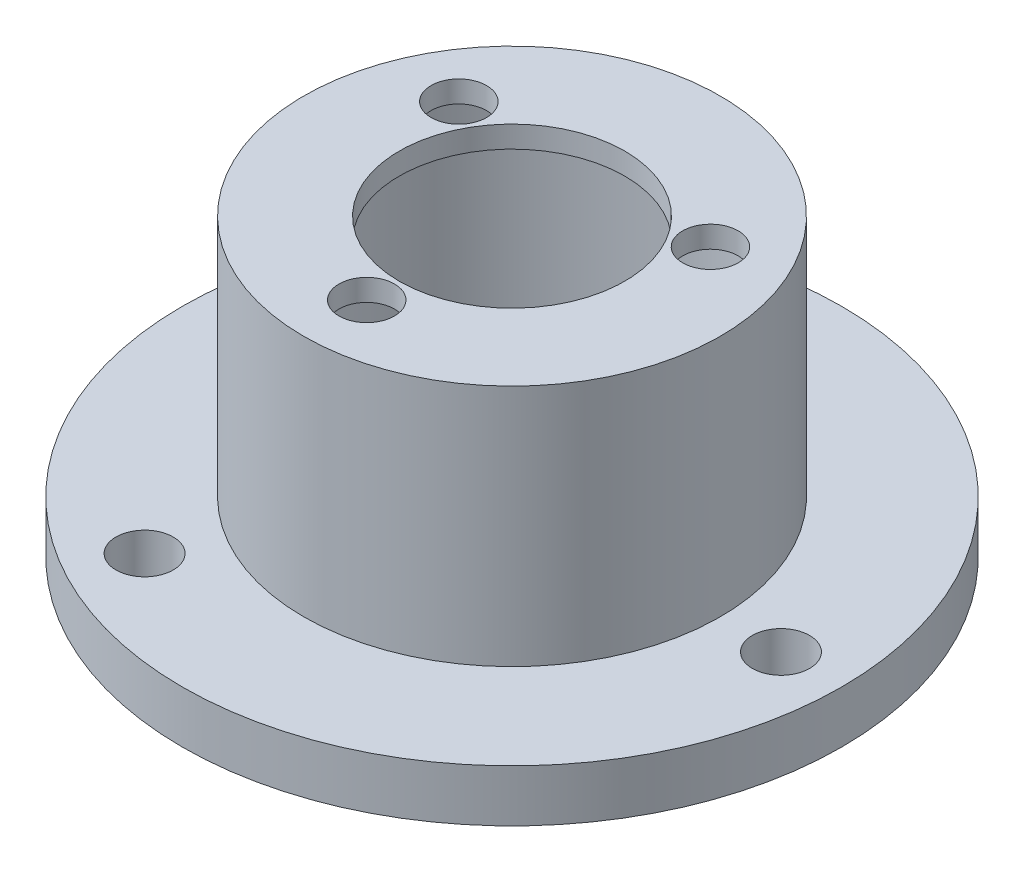
ISO-10303-21;
HEADER;
FILE_DESCRIPTION(('STEP AP214'),'2;1');
FILE_NAME('part.step','',(''),(''),'','','');
FILE_SCHEMA(('AUTOMOTIVE_DESIGN { 1 0 10303 214 1 1 1 1 }'));
ENDSEC;
DATA;
#1=APPLICATION_CONTEXT('core data for automotive mechanical design processes');
#2=APPLICATION_PROTOCOL_DEFINITION('international standard','automotive_design',2000,#1);
#3=PRODUCT_CONTEXT('',#1,'mechanical');
#4=PRODUCT('Part','Part','',(#3));
#5=PRODUCT_RELATED_PRODUCT_CATEGORY('part','',(#4));
#6=PRODUCT_DEFINITION_FORMATION('','',#4);
#7=PRODUCT_DEFINITION_CONTEXT('part definition',#1,'design');
#8=PRODUCT_DEFINITION('design','',#6,#7);
#9=PRODUCT_DEFINITION_SHAPE('','',#8);
#10=(LENGTH_UNIT() NAMED_UNIT(*) SI_UNIT(.MILLI.,.METRE.));
#11=(NAMED_UNIT(*) PLANE_ANGLE_UNIT() SI_UNIT($,.RADIAN.));
#12=(NAMED_UNIT(*) SI_UNIT($,.STERADIAN.) SOLID_ANGLE_UNIT());
#13=UNCERTAINTY_MEASURE_WITH_UNIT(LENGTH_MEASURE(1.E-05),#10,'distance_accuracy_value','');
#14=(GEOMETRIC_REPRESENTATION_CONTEXT(3) GLOBAL_UNCERTAINTY_ASSIGNED_CONTEXT((#13)) GLOBAL_UNIT_ASSIGNED_CONTEXT((#10,
#11,#12)) REPRESENTATION_CONTEXT('',''));
#15=CARTESIAN_POINT('',(0.,0.,0.));
#16=DIRECTION('',(0.,0.,1.));
#17=DIRECTION('',(1.,0.,0.));
#18=AXIS2_PLACEMENT_3D('',#15,#16,#17);
#19=CARTESIAN_POINT('',(0.,3.,0.));
#20=DIRECTION('',(0.,-1.,0.));
#21=DIRECTION('',(0.,0.,-1.));
#22=AXIS2_PLACEMENT_3D('',#19,#20,#21);
#23=CYLINDRICAL_SURFACE('',#22,11.);
#24=CARTESIAN_POINT('',(0.,0.,0.));
#25=DIRECTION('',(0.,1.,0.));
#26=DIRECTION('',(0.,0.,1.));
#27=AXIS2_PLACEMENT_3D('',#24,#25,#26);
#28=CIRCLE('',#27,11.);
#29=CARTESIAN_POINT('',(0.,0.,11.));
#30=VERTEX_POINT('',#29);
#31=EDGE_CURVE('E58',#30,#30,#28,.T.);
#32=ORIENTED_EDGE('',*,*,#31,.F.);
#33=EDGE_LOOP('',(#32));
#34=FACE_BOUND('',#33,.T.);
#35=CARTESIAN_POINT('',(0.,15.75,0.));
#36=DIRECTION('',(0.,1.,0.));
#37=DIRECTION('',(0.,0.,1.));
#38=AXIS2_PLACEMENT_3D('',#35,#36,#37);
#39=CIRCLE('',#38,11.);
#40=CARTESIAN_POINT('',(0.,15.75,11.));
#41=VERTEX_POINT('',#40);
#42=EDGE_CURVE('E66',#41,#41,#39,.T.);
#43=ORIENTED_EDGE('',*,*,#42,.T.);
#44=EDGE_LOOP('',(#43));
#45=FACE_BOUND('',#44,.T.);
#46=ADVANCED_FACE('F45',(#34,#45),#23,.F.);
#47=CARTESIAN_POINT('',(0.,3.,0.));
#48=DIRECTION('',(0.,1.,0.));
#49=DIRECTION('',(0.,0.,1.));
#50=AXIS2_PLACEMENT_3D('',#47,#48,#49);
#51=PLANE('',#50);
#52=CARTESIAN_POINT('',(-7.75000000000001,3.,-13.4233937586588));
#53=DIRECTION('',(0.,1.,0.));
#54=DIRECTION('',(0.,0.,1.));
#55=AXIS2_PLACEMENT_3D('',#52,#53,#54);
#56=CIRCLE('',#55,1.65);
#57=CARTESIAN_POINT('',(-7.75000000000001,3.,-11.7733937586588));
#58=VERTEX_POINT('',#57);
#59=EDGE_CURVE('E107',#58,#58,#56,.T.);
#60=ORIENTED_EDGE('',*,*,#59,.F.);
#61=EDGE_LOOP('',(#60));
#62=FACE_BOUND('',#61,.T.);
#63=CARTESIAN_POINT('',(-7.75000000000001,3.,13.4233937586588));
#64=DIRECTION('',(0.,1.,0.));
#65=DIRECTION('',(0.,0.,1.));
#66=AXIS2_PLACEMENT_3D('',#63,#64,#65);
#67=CIRCLE('',#66,1.65);
#68=CARTESIAN_POINT('',(-7.75000000000001,3.,15.0733937586588));
#69=VERTEX_POINT('',#68);
#70=EDGE_CURVE('E101',#69,#69,#67,.T.);
#71=ORIENTED_EDGE('',*,*,#70,.F.);
#72=EDGE_LOOP('',(#71));
#73=FACE_BOUND('',#72,.T.);
#74=CARTESIAN_POINT('',(15.5,3.,0.));
#75=DIRECTION('',(0.,1.,0.));
#76=DIRECTION('',(0.,0.,1.));
#77=AXIS2_PLACEMENT_3D('',#74,#75,#76);
#78=CIRCLE('',#77,1.65);
#79=CARTESIAN_POINT('',(15.5,3.,1.65));
#80=VERTEX_POINT('',#79);
#81=EDGE_CURVE('E95',#80,#80,#78,.T.);
#82=ORIENTED_EDGE('',*,*,#81,.F.);
#83=EDGE_LOOP('',(#82));
#84=FACE_BOUND('',#83,.T.);
#85=CARTESIAN_POINT('',(0.,3.,0.));
#86=DIRECTION('',(0.,1.,0.));
#87=DIRECTION('',(0.,0.,1.));
#88=AXIS2_PLACEMENT_3D('',#85,#86,#87);
#89=CIRCLE('',#88,19.);
#90=CARTESIAN_POINT('',(0.,3.,19.));
#91=VERTEX_POINT('',#90);
#92=EDGE_CURVE('E10',#91,#91,#89,.T.);
#93=ORIENTED_EDGE('',*,*,#92,.T.);
#94=EDGE_LOOP('',(#93));
#95=FACE_BOUND('',#94,.T.);
#96=CARTESIAN_POINT('',(0.,3.,0.));
#97=DIRECTION('',(0.,1.,0.));
#98=DIRECTION('',(0.,0.,1.));
#99=AXIS2_PLACEMENT_3D('',#96,#97,#98);
#100=CIRCLE('',#99,12.);
#101=CARTESIAN_POINT('',(0.,3.,12.));
#102=VERTEX_POINT('',#101);
#103=EDGE_CURVE('E63',#102,#102,#100,.T.);
#104=ORIENTED_EDGE('',*,*,#103,.F.);
#105=EDGE_LOOP('',(#104));
#106=FACE_BOUND('',#105,.T.);
#107=ADVANCED_FACE('F113',(#62,#73,#84,#95,#106),#51,.T.);
#108=CARTESIAN_POINT('',(0.,0.,0.));
#109=DIRECTION('',(0.,1.,0.));
#110=DIRECTION('',(0.,0.,1.));
#111=AXIS2_PLACEMENT_3D('',#108,#109,#110);
#112=PLANE('',#111);
#113=CARTESIAN_POINT('',(-7.75000000000001,0.,-13.4233937586588));
#114=DIRECTION('',(0.,1.,0.));
#115=DIRECTION('',(0.,0.,1.));
#116=AXIS2_PLACEMENT_3D('',#113,#114,#115);
#117=CIRCLE('',#116,1.65);
#118=CARTESIAN_POINT('',(-7.75000000000001,0.,-11.7733937586588));
#119=VERTEX_POINT('',#118);
#120=EDGE_CURVE('E104',#119,#119,#117,.T.);
#121=ORIENTED_EDGE('',*,*,#120,.T.);
#122=EDGE_LOOP('',(#121));
#123=FACE_BOUND('',#122,.T.);
#124=CARTESIAN_POINT('',(-7.75000000000001,0.,13.4233937586588));
#125=DIRECTION('',(0.,1.,0.));
#126=DIRECTION('',(0.,0.,1.));
#127=AXIS2_PLACEMENT_3D('',#124,#125,#126);
#128=CIRCLE('',#127,1.65);
#129=CARTESIAN_POINT('',(-7.75000000000001,0.,15.0733937586588));
#130=VERTEX_POINT('',#129);
#131=EDGE_CURVE('E98',#130,#130,#128,.T.);
#132=ORIENTED_EDGE('',*,*,#131,.T.);
#133=EDGE_LOOP('',(#132));
#134=FACE_BOUND('',#133,.T.);
#135=CARTESIAN_POINT('',(15.5,0.,0.));
#136=DIRECTION('',(0.,1.,0.));
#137=DIRECTION('',(0.,0.,1.));
#138=AXIS2_PLACEMENT_3D('',#135,#136,#137);
#139=CIRCLE('',#138,1.65);
#140=CARTESIAN_POINT('',(15.5,0.,1.65));
#141=VERTEX_POINT('',#140);
#142=EDGE_CURVE('E92',#141,#141,#139,.T.);
#143=ORIENTED_EDGE('',*,*,#142,.T.);
#144=EDGE_LOOP('',(#143));
#145=FACE_BOUND('',#144,.T.);
#146=CARTESIAN_POINT('',(0.,0.,0.));
#147=DIRECTION('',(0.,1.,0.));
#148=DIRECTION('',(0.,0.,1.));
#149=AXIS2_PLACEMENT_3D('',#146,#147,#148);
#150=CIRCLE('',#149,19.);
#151=CARTESIAN_POINT('',(0.,0.,19.));
#152=VERTEX_POINT('',#151);
#153=EDGE_CURVE('E53',#152,#152,#150,.T.);
#154=ORIENTED_EDGE('',*,*,#153,.F.);
#155=EDGE_LOOP('',(#154));
#156=FACE_BOUND('',#155,.T.);
#157=ORIENTED_EDGE('',*,*,#31,.T.);
#158=EDGE_LOOP('',(#157));
#159=FACE_BOUND('',#158,.T.);
#160=ADVANCED_FACE('F116',(#123,#134,#145,#156,#159),#112,.F.);
#161=CARTESIAN_POINT('',(0.,3.,0.));
#162=DIRECTION('',(0.,-1.,0.));
#163=DIRECTION('',(0.,0.,-1.));
#164=AXIS2_PLACEMENT_3D('',#161,#162,#163);
#165=CYLINDRICAL_SURFACE('',#164,19.);
#166=ORIENTED_EDGE('',*,*,#92,.F.);
#167=EDGE_LOOP('',(#166));
#168=FACE_BOUND('',#167,.T.);
#169=ORIENTED_EDGE('',*,*,#153,.T.);
#170=EDGE_LOOP('',(#169));
#171=FACE_BOUND('',#170,.T.);
#172=ADVANCED_FACE('F47',(#168,#171),#165,.T.);
#173=CARTESIAN_POINT('',(0.,17.,0.));
#174=DIRECTION('',(0.,1.,0.));
#175=DIRECTION('',(0.,0.,1.));
#176=AXIS2_PLACEMENT_3D('',#173,#174,#175);
#177=PLANE('',#176);
#178=CARTESIAN_POINT('',(-7.25,17.,-4.18586835487436));
#179=DIRECTION('',(0.,1.,0.));
#180=DIRECTION('',(0.,0.,1.));
#181=AXIS2_PLACEMENT_3D('',#178,#179,#180);
#182=CIRCLE('',#181,1.6);
#183=CARTESIAN_POINT('',(-7.25,17.,-2.58586835487436));
#184=VERTEX_POINT('',#183);
#185=EDGE_CURVE('E89',#184,#184,#182,.T.);
#186=ORIENTED_EDGE('',*,*,#185,.F.);
#187=EDGE_LOOP('',(#186));
#188=FACE_BOUND('',#187,.T.);
#189=CARTESIAN_POINT('',(7.25,17.,-4.18586835487436));
#190=DIRECTION('',(0.,1.,0.));
#191=DIRECTION('',(0.,0.,1.));
#192=AXIS2_PLACEMENT_3D('',#189,#190,#191);
#193=CIRCLE('',#192,1.6);
#194=CARTESIAN_POINT('',(7.25,17.,-2.58586835487436));
#195=VERTEX_POINT('',#194);
#196=EDGE_CURVE('E86',#195,#195,#193,.T.);
#197=ORIENTED_EDGE('',*,*,#196,.F.);
#198=EDGE_LOOP('',(#197));
#199=FACE_BOUND('',#198,.T.);
#200=CARTESIAN_POINT('',(0.,17.,8.3715));
#201=DIRECTION('',(0.,1.,0.));
#202=DIRECTION('',(0.,0.,1.));
#203=AXIS2_PLACEMENT_3D('',#200,#201,#202);
#204=CIRCLE('',#203,1.6);
#205=CARTESIAN_POINT('',(0.,17.,9.9715));
#206=VERTEX_POINT('',#205);
#207=EDGE_CURVE('E80',#206,#206,#204,.T.);
#208=ORIENTED_EDGE('',*,*,#207,.F.);
#209=EDGE_LOOP('',(#208));
#210=FACE_BOUND('',#209,.T.);
#211=CARTESIAN_POINT('',(0.,17.,0.));
#212=DIRECTION('',(0.,1.,0.));
#213=DIRECTION('',(0.,0.,1.));
#214=AXIS2_PLACEMENT_3D('',#211,#212,#213);
#215=CIRCLE('',#214,12.);
#216=CARTESIAN_POINT('',(0.,17.,12.));
#217=VERTEX_POINT('',#216);
#218=EDGE_CURVE('E62',#217,#217,#215,.T.);
#219=ORIENTED_EDGE('',*,*,#218,.T.);
#220=EDGE_LOOP('',(#219));
#221=FACE_BOUND('',#220,.T.);
#222=CARTESIAN_POINT('',(0.,17.,0.));
#223=DIRECTION('',(0.,1.,0.));
#224=DIRECTION('',(0.,0.,1.));
#225=AXIS2_PLACEMENT_3D('',#222,#223,#224);
#226=CIRCLE('',#225,6.5);
#227=CARTESIAN_POINT('',(0.,17.,6.5));
#228=VERTEX_POINT('',#227);
#229=EDGE_CURVE('E72',#228,#228,#226,.T.);
#230=ORIENTED_EDGE('',*,*,#229,.F.);
#231=EDGE_LOOP('',(#230));
#232=FACE_BOUND('',#231,.T.);
#233=ADVANCED_FACE('F127',(#188,#199,#210,#221,#232),#177,.T.);
#234=CARTESIAN_POINT('',(0.,17.,0.));
#235=DIRECTION('',(0.,-1.,0.));
#236=DIRECTION('',(0.,0.,-1.));
#237=AXIS2_PLACEMENT_3D('',#234,#235,#236);
#238=CYLINDRICAL_SURFACE('',#237,12.);
#239=ORIENTED_EDGE('',*,*,#218,.F.);
#240=EDGE_LOOP('',(#239));
#241=FACE_BOUND('',#240,.T.);
#242=ORIENTED_EDGE('',*,*,#103,.T.);
#243=EDGE_LOOP('',(#242));
#244=FACE_BOUND('',#243,.T.);
#245=ADVANCED_FACE('F124',(#241,#244),#238,.T.);
#246=CARTESIAN_POINT('',(0.,15.75,0.));
#247=DIRECTION('',(0.,1.,0.));
#248=DIRECTION('',(0.,0.,1.));
#249=AXIS2_PLACEMENT_3D('',#246,#247,#248);
#250=PLANE('',#249);
#251=CARTESIAN_POINT('',(-7.25,15.75,-4.18586835487436));
#252=DIRECTION('',(0.,1.,0.));
#253=DIRECTION('',(0.,0.,1.));
#254=AXIS2_PLACEMENT_3D('',#251,#252,#253);
#255=CIRCLE('',#254,1.6);
#256=CARTESIAN_POINT('',(-7.25,15.75,-2.58586835487436));
#257=VERTEX_POINT('',#256);
#258=EDGE_CURVE('E49',#257,#257,#255,.T.);
#259=ORIENTED_EDGE('',*,*,#258,.T.);
#260=EDGE_LOOP('',(#259));
#261=FACE_BOUND('',#260,.T.);
#262=CARTESIAN_POINT('',(7.25,15.75,-4.18586835487436));
#263=DIRECTION('',(0.,1.,0.));
#264=DIRECTION('',(0.,0.,1.));
#265=AXIS2_PLACEMENT_3D('',#262,#263,#264);
#266=CIRCLE('',#265,1.6);
#267=CARTESIAN_POINT('',(7.25,15.75,-2.58586835487436));
#268=VERTEX_POINT('',#267);
#269=EDGE_CURVE('E83',#268,#268,#266,.T.);
#270=ORIENTED_EDGE('',*,*,#269,.T.);
#271=EDGE_LOOP('',(#270));
#272=FACE_BOUND('',#271,.T.);
#273=CARTESIAN_POINT('',(0.,15.75,8.3715));
#274=DIRECTION('',(0.,1.,0.));
#275=DIRECTION('',(0.,0.,1.));
#276=AXIS2_PLACEMENT_3D('',#273,#274,#275);
#277=CIRCLE('',#276,1.6);
#278=CARTESIAN_POINT('',(0.,15.75,9.9715));
#279=VERTEX_POINT('',#278);
#280=EDGE_CURVE('E75',#279,#279,#277,.T.);
#281=ORIENTED_EDGE('',*,*,#280,.T.);
#282=EDGE_LOOP('',(#281));
#283=FACE_BOUND('',#282,.T.);
#284=ORIENTED_EDGE('',*,*,#42,.F.);
#285=EDGE_LOOP('',(#284));
#286=FACE_BOUND('',#285,.T.);
#287=CARTESIAN_POINT('',(0.,15.75,0.));
#288=DIRECTION('',(0.,1.,0.));
#289=DIRECTION('',(0.,0.,1.));
#290=AXIS2_PLACEMENT_3D('',#287,#288,#289);
#291=CIRCLE('',#290,6.5);
#292=CARTESIAN_POINT('',(0.,15.75,6.5));
#293=VERTEX_POINT('',#292);
#294=EDGE_CURVE('E71',#293,#293,#291,.T.);
#295=ORIENTED_EDGE('',*,*,#294,.T.);
#296=EDGE_LOOP('',(#295));
#297=FACE_BOUND('',#296,.T.);
#298=ADVANCED_FACE('F126',(#261,#272,#283,#286,#297),#250,.F.);
#299=CARTESIAN_POINT('',(0.,15.75,0.));
#300=DIRECTION('',(0.,1.,0.));
#301=DIRECTION('',(0.,0.,1.));
#302=AXIS2_PLACEMENT_3D('',#299,#300,#301);
#303=CYLINDRICAL_SURFACE('',#302,6.5);
#304=ORIENTED_EDGE('',*,*,#294,.F.);
#305=EDGE_LOOP('',(#304));
#306=FACE_BOUND('',#305,.T.);
#307=ORIENTED_EDGE('',*,*,#229,.T.);
#308=EDGE_LOOP('',(#307));
#309=FACE_BOUND('',#308,.T.);
#310=ADVANCED_FACE('F135',(#306,#309),#303,.F.);
#311=CARTESIAN_POINT('',(0.,17.,8.3715));
#312=DIRECTION('',(0.,1.,0.));
#313=DIRECTION('',(0.,0.,1.));
#314=AXIS2_PLACEMENT_3D('',#311,#312,#313);
#315=CYLINDRICAL_SURFACE('',#314,1.6);
#316=ORIENTED_EDGE('',*,*,#207,.T.);
#317=EDGE_LOOP('',(#316));
#318=FACE_BOUND('',#317,.T.);
#319=ORIENTED_EDGE('',*,*,#280,.F.);
#320=EDGE_LOOP('',(#319));
#321=FACE_BOUND('',#320,.T.);
#322=ADVANCED_FACE('F184',(#318,#321),#315,.F.);
#323=CARTESIAN_POINT('',(7.25,17.,-4.18586835487436));
#324=DIRECTION('',(0.,1.,0.));
#325=DIRECTION('',(0.,0.,1.));
#326=AXIS2_PLACEMENT_3D('',#323,#324,#325);
#327=CYLINDRICAL_SURFACE('',#326,1.6);
#328=ORIENTED_EDGE('',*,*,#196,.T.);
#329=EDGE_LOOP('',(#328));
#330=FACE_BOUND('',#329,.T.);
#331=ORIENTED_EDGE('',*,*,#269,.F.);
#332=EDGE_LOOP('',(#331));
#333=FACE_BOUND('',#332,.T.);
#334=ADVANCED_FACE('F177',(#330,#333),#327,.F.);
#335=CARTESIAN_POINT('',(-7.25,17.,-4.18586835487436));
#336=DIRECTION('',(0.,1.,0.));
#337=DIRECTION('',(0.,0.,1.));
#338=AXIS2_PLACEMENT_3D('',#335,#336,#337);
#339=CYLINDRICAL_SURFACE('',#338,1.6);
#340=ORIENTED_EDGE('',*,*,#185,.T.);
#341=EDGE_LOOP('',(#340));
#342=FACE_BOUND('',#341,.T.);
#343=ORIENTED_EDGE('',*,*,#258,.F.);
#344=EDGE_LOOP('',(#343));
#345=FACE_BOUND('',#344,.T.);
#346=ADVANCED_FACE('F169',(#342,#345),#339,.F.);
#347=CARTESIAN_POINT('',(15.5,3.,0.));
#348=DIRECTION('',(0.,1.,0.));
#349=DIRECTION('',(0.,0.,1.));
#350=AXIS2_PLACEMENT_3D('',#347,#348,#349);
#351=CYLINDRICAL_SURFACE('',#350,1.65);
#352=ORIENTED_EDGE('',*,*,#142,.F.);
#353=EDGE_LOOP('',(#352));
#354=FACE_BOUND('',#353,.T.);
#355=ORIENTED_EDGE('',*,*,#81,.T.);
#356=EDGE_LOOP('',(#355));
#357=FACE_BOUND('',#356,.T.);
#358=ADVANCED_FACE('F165',(#354,#357),#351,.F.);
#359=CARTESIAN_POINT('',(-7.75000000000001,3.,13.4233937586588));
#360=DIRECTION('',(0.,1.,0.));
#361=DIRECTION('',(0.,0.,1.));
#362=AXIS2_PLACEMENT_3D('',#359,#360,#361);
#363=CYLINDRICAL_SURFACE('',#362,1.65);
#364=ORIENTED_EDGE('',*,*,#131,.F.);
#365=EDGE_LOOP('',(#364));
#366=FACE_BOUND('',#365,.T.);
#367=ORIENTED_EDGE('',*,*,#70,.T.);
#368=EDGE_LOOP('',(#367));
#369=FACE_BOUND('',#368,.T.);
#370=ADVANCED_FACE('F168',(#366,#369),#363,.F.);
#371=CARTESIAN_POINT('',(-7.75000000000001,3.,-13.4233937586588));
#372=DIRECTION('',(0.,1.,0.));
#373=DIRECTION('',(0.,0.,1.));
#374=AXIS2_PLACEMENT_3D('',#371,#372,#373);
#375=CYLINDRICAL_SURFACE('',#374,1.65);
#376=ORIENTED_EDGE('',*,*,#120,.F.);
#377=EDGE_LOOP('',(#376));
#378=FACE_BOUND('',#377,.T.);
#379=ORIENTED_EDGE('',*,*,#59,.T.);
#380=EDGE_LOOP('',(#379));
#381=FACE_BOUND('',#380,.T.);
#382=ADVANCED_FACE('F111',(#378,#381),#375,.F.);
#383=CLOSED_SHELL('',(#46,#107,#160,#172,#233,#245,#298,#310,#322,#334,#346,#358,#370,#382));
#384=MANIFOLD_SOLID_BREP('B2',#383);
#385=ADVANCED_BREP_SHAPE_REPRESENTATION('',(#18,#384),#14);
#386=SHAPE_DEFINITION_REPRESENTATION(#9,#385);
ENDSEC;
END-ISO-10303-21;
